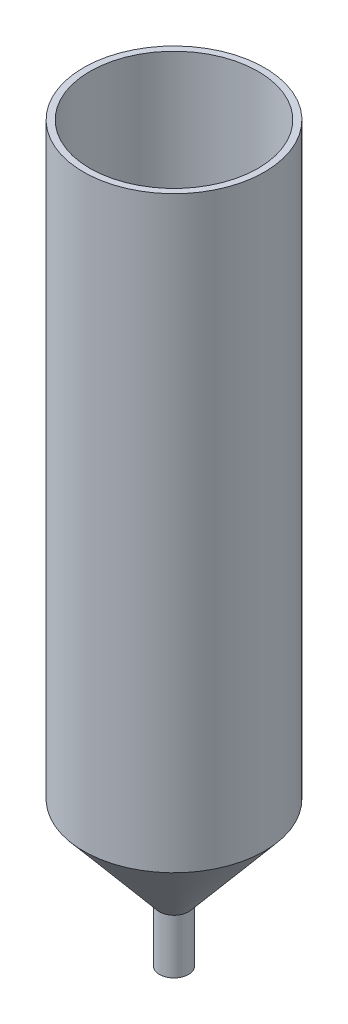
ISO-10303-21;
HEADER;
FILE_DESCRIPTION(('STEP AP214'),'2;1');
FILE_NAME('part.step','',(''),(''),'','','');
FILE_SCHEMA(('AUTOMOTIVE_DESIGN { 1 0 10303 214 1 1 1 1 }'));
ENDSEC;
DATA;
#1=APPLICATION_CONTEXT('core data for automotive mechanical design processes');
#2=APPLICATION_PROTOCOL_DEFINITION('international standard','automotive_design',2000,#1);
#3=PRODUCT_CONTEXT('',#1,'mechanical');
#4=PRODUCT('Part','Part','',(#3));
#5=PRODUCT_RELATED_PRODUCT_CATEGORY('part','',(#4));
#6=PRODUCT_DEFINITION_FORMATION('','',#4);
#7=PRODUCT_DEFINITION_CONTEXT('part definition',#1,'design');
#8=PRODUCT_DEFINITION('design','',#6,#7);
#9=PRODUCT_DEFINITION_SHAPE('','',#8);
#10=(LENGTH_UNIT() NAMED_UNIT(*) SI_UNIT(.MILLI.,.METRE.));
#11=(NAMED_UNIT(*) PLANE_ANGLE_UNIT() SI_UNIT($,.RADIAN.));
#12=(NAMED_UNIT(*) SI_UNIT($,.STERADIAN.) SOLID_ANGLE_UNIT());
#13=UNCERTAINTY_MEASURE_WITH_UNIT(LENGTH_MEASURE(1.E-05),#10,'distance_accuracy_value','');
#14=(GEOMETRIC_REPRESENTATION_CONTEXT(3) GLOBAL_UNCERTAINTY_ASSIGNED_CONTEXT((#13)) GLOBAL_UNIT_ASSIGNED_CONTEXT((#10,
#11,#12)) REPRESENTATION_CONTEXT('',''));
#15=CARTESIAN_POINT('',(0.,0.,0.));
#16=DIRECTION('',(0.,0.,1.));
#17=DIRECTION('',(1.,0.,0.));
#18=AXIS2_PLACEMENT_3D('',#15,#16,#17);
#19=CARTESIAN_POINT('',(-20.0000000000001,0.,0.));
#20=DIRECTION('',(0.,1.,0.));
#21=DIRECTION('',(-1.,0.,0.));
#22=AXIS2_PLACEMENT_3D('',#19,#20,#21);
#23=PLANE('',#22);
#24=CARTESIAN_POINT('',(1.47693143408494E-07,0.,0.));
#25=DIRECTION('',(0.,1.,0.));
#26=DIRECTION('',(-1.,0.,0.));
#27=AXIS2_PLACEMENT_3D('',#24,#25,#26);
#28=CIRCLE('',#27,20.0000001476932);
#29=CARTESIAN_POINT('',(-20.0000000000001,0.,0.));
#30=VERTEX_POINT('',#29);
#31=EDGE_CURVE('E72',#30,#30,#28,.T.);
#32=ORIENTED_EDGE('',*,*,#31,.T.);
#33=EDGE_LOOP('',(#32));
#34=FACE_BOUND('',#33,.T.);
#35=CARTESIAN_POINT('',(1.47693143408494E-07,0.,0.));
#36=DIRECTION('',(0.,1.,0.));
#37=DIRECTION('',(-1.,0.,0.));
#38=AXIS2_PLACEMENT_3D('',#35,#36,#37);
#39=CIRCLE('',#38,18.5816015243412);
#40=CARTESIAN_POINT('',(-18.581601376648,0.,0.));
#41=VERTEX_POINT('',#40);
#42=EDGE_CURVE('E10',#41,#41,#39,.T.);
#43=ORIENTED_EDGE('',*,*,#42,.F.);
#44=EDGE_LOOP('',(#43));
#45=FACE_BOUND('',#44,.T.);
#46=ADVANCED_FACE('F37',(#34,#45),#23,.T.);
#47=CARTESIAN_POINT('',(1.4769314242871E-07,8.00054349413113,0.));
#48=DIRECTION('',(0.,1.,0.));
#49=DIRECTION('',(-1.,0.,0.));
#50=AXIS2_PLACEMENT_3D('',#47,#48,#49);
#51=CYLINDRICAL_SURFACE('',#50,18.5816015243412);
#52=ORIENTED_EDGE('',*,*,#42,.T.);
#53=EDGE_LOOP('',(#52));
#54=FACE_BOUND('',#53,.T.);
#55=CARTESIAN_POINT('',(1.4769315926568E-07,-129.483745120776,0.));
#56=DIRECTION('',(0.,1.,0.));
#57=DIRECTION('',(-1.,0.,0.));
#58=AXIS2_PLACEMENT_3D('',#55,#56,#57);
#59=CIRCLE('',#58,18.5816015243412);
#60=CARTESIAN_POINT('',(-18.581601376648,-129.483745120776,0.));
#61=VERTEX_POINT('',#60);
#62=EDGE_CURVE('E44',#61,#61,#59,.T.);
#63=ORIENTED_EDGE('',*,*,#62,.F.);
#64=EDGE_LOOP('',(#63));
#65=FACE_BOUND('',#64,.T.);
#66=ADVANCED_FACE('F91',(#54,#65),#51,.F.);
#67=CARTESIAN_POINT('',(1.47693161653909E-07,-148.98511705826,0.));
#68=DIRECTION('',(0.,1.,0.));
#69=DIRECTION('',(-1.,0.,0.));
#70=AXIS2_PLACEMENT_3D('',#67,#68,#69);
#71=CONICAL_SURFACE('',#70,2.21800752414751,0.698131700797733);
#72=ORIENTED_EDGE('',*,*,#62,.T.);
#73=EDGE_LOOP('',(#72));
#74=FACE_BOUND('',#73,.T.);
#75=CARTESIAN_POINT('',(1.47693161653909E-07,-148.98511705826,0.));
#76=DIRECTION('',(0.,1.,0.));
#77=DIRECTION('',(-1.,0.,0.));
#78=AXIS2_PLACEMENT_3D('',#75,#76,#77);
#79=CIRCLE('',#78,2.21800752414751);
#80=CARTESIAN_POINT('',(-2.21800737645435,-148.98511705826,0.));
#81=VERTEX_POINT('',#80);
#82=EDGE_CURVE('E49',#81,#81,#79,.T.);
#83=ORIENTED_EDGE('',*,*,#82,.F.);
#84=EDGE_LOOP('',(#83));
#85=FACE_BOUND('',#84,.T.);
#86=ADVANCED_FACE('F95',(#74,#85),#71,.F.);
#87=CARTESIAN_POINT('',(1.4769314242871E-07,8.00054349413113,0.));
#88=DIRECTION('',(0.,1.,0.));
#89=DIRECTION('',(-1.,0.,0.));
#90=AXIS2_PLACEMENT_3D('',#87,#88,#89);
#91=CYLINDRICAL_SURFACE('',#90,2.21800752414751);
#92=ORIENTED_EDGE('',*,*,#82,.T.);
#93=EDGE_LOOP('',(#92));
#94=FACE_BOUND('',#93,.T.);
#95=CARTESIAN_POINT('',(1.47693163247773E-07,-162.,0.));
#96=DIRECTION('',(0.,1.,0.));
#97=DIRECTION('',(-1.,0.,0.));
#98=AXIS2_PLACEMENT_3D('',#95,#96,#97);
#99=CIRCLE('',#98,2.21800752414751);
#100=CARTESIAN_POINT('',(-2.21800737645434,-162.,0.));
#101=VERTEX_POINT('',#100);
#102=EDGE_CURVE('E54',#101,#101,#99,.T.);
#103=ORIENTED_EDGE('',*,*,#102,.F.);
#104=EDGE_LOOP('',(#103));
#105=FACE_BOUND('',#104,.T.);
#106=ADVANCED_FACE('F99',(#94,#105),#91,.F.);
#107=CARTESIAN_POINT('',(-2.21800737645434,-162.,0.));
#108=DIRECTION('',(0.,-1.,0.));
#109=DIRECTION('',(1.,0.,0.));
#110=AXIS2_PLACEMENT_3D('',#107,#108,#109);
#111=PLANE('',#110);
#112=ORIENTED_EDGE('',*,*,#102,.T.);
#113=EDGE_LOOP('',(#112));
#114=FACE_BOUND('',#113,.T.);
#115=CARTESIAN_POINT('',(1.47693163247773E-07,-162.,0.));
#116=DIRECTION('',(0.,1.,0.));
#117=DIRECTION('',(-1.,0.,0.));
#118=AXIS2_PLACEMENT_3D('',#115,#116,#117);
#119=CIRCLE('',#118,3.21800752414751);
#120=CARTESIAN_POINT('',(-3.21800737645434,-162.,0.));
#121=VERTEX_POINT('',#120);
#122=EDGE_CURVE('E60',#121,#121,#119,.T.);
#123=ORIENTED_EDGE('',*,*,#122,.F.);
#124=EDGE_LOOP('',(#123));
#125=FACE_BOUND('',#124,.T.);
#126=ADVANCED_FACE('F105',(#114,#125),#111,.T.);
#127=CARTESIAN_POINT('',(1.4769314242871E-07,8.00054349413113,0.));
#128=DIRECTION('',(0.,1.,0.));
#129=DIRECTION('',(-1.,0.,0.));
#130=AXIS2_PLACEMENT_3D('',#127,#128,#129);
#131=CYLINDRICAL_SURFACE('',#130,3.21800752414755);
#132=ORIENTED_EDGE('',*,*,#122,.T.);
#133=EDGE_LOOP('',(#132));
#134=FACE_BOUND('',#133,.T.);
#135=CARTESIAN_POINT('',(1.47693161778196E-07,-150.,0.));
#136=DIRECTION('',(0.,1.,0.));
#137=DIRECTION('',(-1.,0.,0.));
#138=AXIS2_PLACEMENT_3D('',#135,#136,#137);
#139=CIRCLE('',#138,3.21800752414759);
#140=CARTESIAN_POINT('',(-3.21800737645442,-150.,0.));
#141=VERTEX_POINT('',#140);
#142=EDGE_CURVE('E64',#141,#141,#139,.T.);
#143=ORIENTED_EDGE('',*,*,#142,.F.);
#144=EDGE_LOOP('',(#143));
#145=FACE_BOUND('',#144,.T.);
#146=ADVANCED_FACE('F87',(#134,#145),#131,.T.);
#147=CARTESIAN_POINT('',(1.47693159328903E-07,-130.,0.));
#148=DIRECTION('',(0.,1.,0.));
#149=DIRECTION('',(-1.,0.,0.));
#150=AXIS2_PLACEMENT_3D('',#147,#148,#149);
#151=CONICAL_SURFACE('',#150,20.0000001476932,0.698131700797733);
#152=ORIENTED_EDGE('',*,*,#142,.T.);
#153=EDGE_LOOP('',(#152));
#154=FACE_BOUND('',#153,.T.);
#155=CARTESIAN_POINT('',(1.47693159328903E-07,-130.,0.));
#156=DIRECTION('',(0.,1.,0.));
#157=DIRECTION('',(-1.,0.,0.));
#158=AXIS2_PLACEMENT_3D('',#155,#156,#157);
#159=CIRCLE('',#158,20.0000001476932);
#160=CARTESIAN_POINT('',(-20.0000000000001,-130.,0.));
#161=VERTEX_POINT('',#160);
#162=EDGE_CURVE('E68',#161,#161,#159,.T.);
#163=ORIENTED_EDGE('',*,*,#162,.F.);
#164=EDGE_LOOP('',(#163));
#165=FACE_BOUND('',#164,.T.);
#166=ADVANCED_FACE('F81',(#154,#165),#151,.T.);
#167=CARTESIAN_POINT('',(1.4769314242871E-07,8.00054349413113,0.));
#168=DIRECTION('',(0.,1.,0.));
#169=DIRECTION('',(-1.,0.,0.));
#170=AXIS2_PLACEMENT_3D('',#167,#168,#169);
#171=CYLINDRICAL_SURFACE('',#170,20.0000001476932);
#172=ORIENTED_EDGE('',*,*,#162,.T.);
#173=EDGE_LOOP('',(#172));
#174=FACE_BOUND('',#173,.T.);
#175=ORIENTED_EDGE('',*,*,#31,.F.);
#176=EDGE_LOOP('',(#175));
#177=FACE_BOUND('',#176,.T.);
#178=ADVANCED_FACE('F79',(#174,#177),#171,.T.);
#179=CLOSED_SHELL('',(#46,#66,#86,#106,#126,#146,#166,#178));
#180=MANIFOLD_SOLID_BREP('B2',#179);
#181=ADVANCED_BREP_SHAPE_REPRESENTATION('',(#18,#180),#14);
#182=SHAPE_DEFINITION_REPRESENTATION(#9,#181);
ENDSEC;
END-ISO-10303-21;
